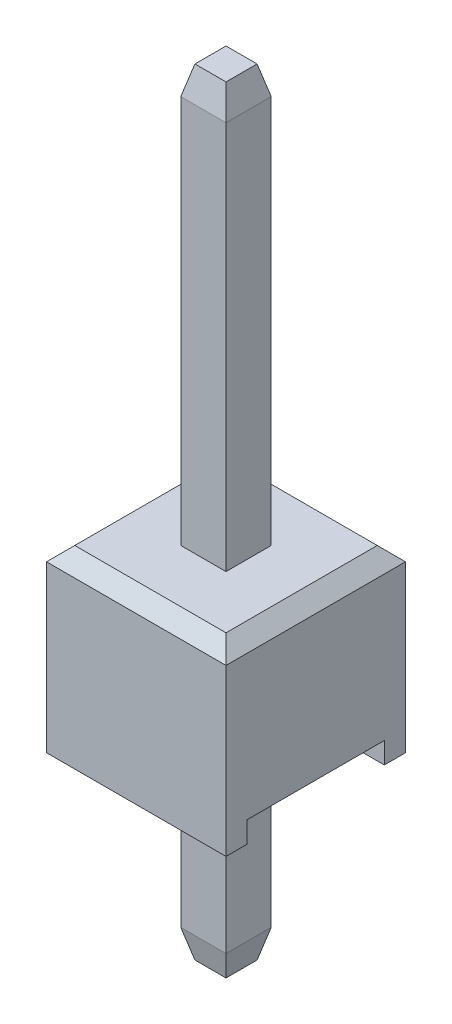
ISO-10303-21;
HEADER;
FILE_DESCRIPTION(('STEP AP214'),'2;1');
FILE_NAME('part.step','',(''),(''),'','','');
FILE_SCHEMA(('AUTOMOTIVE_DESIGN { 1 0 10303 214 1 1 1 1 }'));
ENDSEC;
DATA;
#1=APPLICATION_CONTEXT('core data for automotive mechanical design processes');
#2=APPLICATION_PROTOCOL_DEFINITION('international standard','automotive_design',2000,#1);
#3=PRODUCT_CONTEXT('',#1,'mechanical');
#4=PRODUCT('Part','Part','',(#3));
#5=PRODUCT_RELATED_PRODUCT_CATEGORY('part','',(#4));
#6=PRODUCT_DEFINITION_FORMATION('','',#4);
#7=PRODUCT_DEFINITION_CONTEXT('part definition',#1,'design');
#8=PRODUCT_DEFINITION('design','',#6,#7);
#9=PRODUCT_DEFINITION_SHAPE('','',#8);
#10=(LENGTH_UNIT() NAMED_UNIT(*) SI_UNIT(.MILLI.,.METRE.));
#11=(NAMED_UNIT(*) PLANE_ANGLE_UNIT() SI_UNIT($,.RADIAN.));
#12=(NAMED_UNIT(*) SI_UNIT($,.STERADIAN.) SOLID_ANGLE_UNIT());
#13=UNCERTAINTY_MEASURE_WITH_UNIT(LENGTH_MEASURE(1.E-05),#10,'distance_accuracy_value','');
#14=(GEOMETRIC_REPRESENTATION_CONTEXT(3) GLOBAL_UNCERTAINTY_ASSIGNED_CONTEXT((#13)) GLOBAL_UNIT_ASSIGNED_CONTEXT((#10,
#11,#12)) REPRESENTATION_CONTEXT('',''));
#15=CARTESIAN_POINT('',(0.,0.,0.));
#16=DIRECTION('',(0.,0.,1.));
#17=DIRECTION('',(1.,0.,0.));
#18=AXIS2_PLACEMENT_3D('',#15,#16,#17);
#19=CARTESIAN_POINT('',(-0.32,7.17000000000008,0.219999999999967));
#20=DIRECTION('',(0.,0.242535625036099,0.970142500145396));
#21=DIRECTION('',(0.,-0.970142500145396,0.242535625036099));
#22=AXIS2_PLACEMENT_3D('',#19,#20,#21);
#23=PLANE('',#22);
#24=DIRECTION('',(0.235702260395287,-0.942809041582121,0.235702260395516));
#25=VECTOR('',#24,1.);
#26=CARTESIAN_POINT('',(0.22,7.17000000000008,0.219999999999967));
#27=LINE('',#26,#25);
#28=CARTESIAN_POINT('',(0.220000000000001,7.17000000000008,0.219999999999967));
#29=VERTEX_POINT('',#28);
#30=CARTESIAN_POINT('',(0.319999999999976,6.76999999999998,0.319999999999999));
#31=VERTEX_POINT('',#30);
#32=EDGE_CURVE('E164',#29,#31,#27,.T.);
#33=ORIENTED_EDGE('',*,*,#32,.F.);
#34=DIRECTION('',(1.,0.,0.));
#35=VECTOR('',#34,1.);
#36=CARTESIAN_POINT('',(-0.32,7.17000000000008,0.219999999999967));
#37=LINE('',#36,#35);
#38=CARTESIAN_POINT('',(-0.22,7.17000000000008,0.219999999999967));
#39=VERTEX_POINT('',#38);
#40=EDGE_CURVE('E166',#29,#39,#37,.F.);
#41=ORIENTED_EDGE('',*,*,#40,.T.);
#42=DIRECTION('',(0.235702260395287,0.942809041582121,-0.235702260395516));
#43=VECTOR('',#42,1.);
#44=CARTESIAN_POINT('',(-0.319999999999903,6.76999999999998,0.320000000000048));
#45=LINE('',#44,#43);
#46=CARTESIAN_POINT('',(-0.319999999999988,6.76999999999998,0.319999999999999));
#47=VERTEX_POINT('',#46);
#48=EDGE_CURVE('E20',#47,#39,#45,.T.);
#49=ORIENTED_EDGE('',*,*,#48,.F.);
#50=DIRECTION('',(1.,0.,0.));
#51=VECTOR('',#50,1.);
#52=CARTESIAN_POINT('',(-0.32,6.77,0.320000000000048));
#53=LINE('',#52,#51);
#54=EDGE_CURVE('E189',#31,#47,#53,.F.);
#55=ORIENTED_EDGE('',*,*,#54,.F.);
#56=EDGE_LOOP('',(#33,#41,#49,#55));
#57=FACE_BOUND('',#56,.T.);
#58=ADVANCED_FACE('F17',(#57),#23,.T.);
#59=CARTESIAN_POINT('',(-0.32,-3.41000000000003,-0.320000000000001));
#60=DIRECTION('',(0.,0.242535625036099,0.970142500145396));
#61=DIRECTION('',(0.,-0.970142500145396,0.242535625036099));
#62=AXIS2_PLACEMENT_3D('',#59,#60,#61);
#63=PLANE('',#62);
#64=DIRECTION('',(-1.,0.,0.));
#65=VECTOR('',#64,1.);
#66=CARTESIAN_POINT('',(-0.32,-3.41000000000003,-0.320000000000001));
#67=LINE('',#66,#65);
#68=CARTESIAN_POINT('',(0.32,-3.41000000000003,-0.320000000000001));
#69=VERTEX_POINT('',#68);
#70=CARTESIAN_POINT('',(-0.32,-3.41000000000003,-0.320000000000001));
#71=VERTEX_POINT('',#70);
#72=EDGE_CURVE('E205',#69,#71,#67,.T.);
#73=ORIENTED_EDGE('',*,*,#72,.F.);
#74=DIRECTION('',(-0.235702260395287,-0.942809041582121,0.235702260395516));
#75=VECTOR('',#74,1.);
#76=CARTESIAN_POINT('',(0.32,-3.41000000000003,-0.320000000000001));
#77=LINE('',#76,#75);
#78=CARTESIAN_POINT('',(0.220000000000024,-3.81000000000005,-0.220000000000048));
#79=VERTEX_POINT('',#78);
#80=EDGE_CURVE('E201',#69,#79,#77,.T.);
#81=ORIENTED_EDGE('',*,*,#80,.T.);
#82=DIRECTION('',(1.,0.,0.));
#83=VECTOR('',#82,1.);
#84=CARTESIAN_POINT('',(-0.32,-3.81000000000003,-0.22));
#85=LINE('',#84,#83);
#86=CARTESIAN_POINT('',(-0.220000000000024,-3.81000000000004,-0.220000000000024));
#87=VERTEX_POINT('',#86);
#88=EDGE_CURVE('E193',#87,#79,#85,.T.);
#89=ORIENTED_EDGE('',*,*,#88,.F.);
#90=DIRECTION('',(-0.235702260395287,0.942809041582121,-0.235702260395516));
#91=VECTOR('',#90,1.);
#92=CARTESIAN_POINT('',(-0.220000000000097,-3.81000000000006,-0.22));
#93=LINE('',#92,#91);
#94=EDGE_CURVE('E199',#87,#71,#93,.T.);
#95=ORIENTED_EDGE('',*,*,#94,.T.);
#96=EDGE_LOOP('',(#73,#81,#89,#95));
#97=FACE_BOUND('',#96,.T.);
#98=ADVANCED_FACE('F688',(#97),#63,.F.);
#99=CARTESIAN_POINT('',(-0.22,7.17000000000016,-0.319999999999966));
#100=DIRECTION('',(-0.970142500145391,0.242535625036099,0.));
#101=DIRECTION('',(-0.242535625036098,-0.970142500145396,0.));
#102=AXIS2_PLACEMENT_3D('',#99,#100,#101);
#103=PLANE('',#102);
#104=DIRECTION('',(0.235702260395516,0.942809041582126,0.235702260395288));
#105=VECTOR('',#104,1.);
#106=CARTESIAN_POINT('',(-0.32,6.77000000000014,-0.319999999999904));
#107=LINE('',#106,#105);
#108=CARTESIAN_POINT('',(-0.319999999999951,6.77000000000015,-0.319999999999989));
#109=VERTEX_POINT('',#108);
#110=CARTESIAN_POINT('',(-0.22,7.17000000000008,-0.219999999999967));
#111=VERTEX_POINT('',#110);
#112=EDGE_CURVE('E219',#109,#111,#107,.T.);
#113=ORIENTED_EDGE('',*,*,#112,.F.);
#114=DIRECTION('',(0.,0.,1.00000000000001));
#115=VECTOR('',#114,1.);
#116=CARTESIAN_POINT('',(-0.32,6.77,0.320000000000048));
#117=LINE('',#116,#115);
#118=EDGE_CURVE('E178',#47,#109,#117,.F.);
#119=ORIENTED_EDGE('',*,*,#118,.F.);
#120=ORIENTED_EDGE('',*,*,#48,.T.);
#121=DIRECTION('',(0.,0.,-1.00000000000001));
#122=VECTOR('',#121,1.);
#123=CARTESIAN_POINT('',(-0.22,7.17000000000016,-0.319999999999966));
#124=LINE('',#123,#122);
#125=EDGE_CURVE('E172',#39,#111,#124,.T.);
#126=ORIENTED_EDGE('',*,*,#125,.T.);
#127=EDGE_LOOP('',(#113,#119,#120,#126));
#128=FACE_BOUND('',#127,.T.);
#129=ADVANCED_FACE('F175',(#128),#103,.T.);
#130=CARTESIAN_POINT('',(-0.32,7.17000000000016,-0.319999999999966));
#131=DIRECTION('',(0.,-1.00000000000001,0.));
#132=DIRECTION('',(0.,0.,-1.00000000000001));
#133=AXIS2_PLACEMENT_3D('',#130,#131,#132);
#134=PLANE('',#133);
#135=ORIENTED_EDGE('',*,*,#40,.F.);
#136=DIRECTION('',(0.,0.,1.00000000000001));
#137=VECTOR('',#136,1.);
#138=CARTESIAN_POINT('',(0.22,7.17000000000016,-0.319999999999966));
#139=LINE('',#138,#137);
#140=CARTESIAN_POINT('',(0.22,7.17000000000008,-0.219999999999967));
#141=VERTEX_POINT('',#140);
#142=EDGE_CURVE('E185',#141,#29,#139,.T.);
#143=ORIENTED_EDGE('',*,*,#142,.F.);
#144=DIRECTION('',(1.,0.,0.));
#145=VECTOR('',#144,1.);
#146=CARTESIAN_POINT('',(-0.32,7.17000000000008,-0.219999999999967));
#147=LINE('',#146,#145);
#148=EDGE_CURVE('E182',#111,#141,#147,.T.);
#149=ORIENTED_EDGE('',*,*,#148,.F.);
#150=ORIENTED_EDGE('',*,*,#125,.F.);
#151=EDGE_LOOP('',(#135,#143,#149,#150));
#152=FACE_BOUND('',#151,.T.);
#153=ADVANCED_FACE('F180',(#152),#134,.F.);
#154=CARTESIAN_POINT('',(0.22,7.17000000000016,-0.319999999999966));
#155=DIRECTION('',(0.970142500145391,0.242535625036099,0.));
#156=DIRECTION('',(-0.242535625036098,0.970142500145396,0.));
#157=AXIS2_PLACEMENT_3D('',#154,#155,#156);
#158=PLANE('',#157);
#159=DIRECTION('',(0.235702260395516,-0.942809041582126,-0.235702260395288));
#160=VECTOR('',#159,1.);
#161=CARTESIAN_POINT('',(0.220000000000001,7.17000000000008,-0.219999999999967));
#162=LINE('',#161,#160);
#163=CARTESIAN_POINT('',(0.319999999999951,6.77000000000015,-0.319999999999977));
#164=VERTEX_POINT('',#163);
#165=EDGE_CURVE('E216',#141,#164,#162,.T.);
#166=ORIENTED_EDGE('',*,*,#165,.F.);
#167=ORIENTED_EDGE('',*,*,#142,.T.);
#168=ORIENTED_EDGE('',*,*,#32,.T.);
#169=DIRECTION('',(0.,0.,-1.00000000000001));
#170=VECTOR('',#169,1.);
#171=CARTESIAN_POINT('',(0.32,6.77,0.320000000000048));
#172=LINE('',#171,#170);
#173=EDGE_CURVE('E222',#164,#31,#172,.F.);
#174=ORIENTED_EDGE('',*,*,#173,.F.);
#175=EDGE_LOOP('',(#166,#167,#168,#174));
#176=FACE_BOUND('',#175,.T.);
#177=ADVANCED_FACE('F664',(#176),#158,.T.);
#178=CARTESIAN_POINT('',(-0.32,-3.81000000000002,0.320000000000023));
#179=DIRECTION('',(0.,0.,1.00000000000001));
#180=DIRECTION('',(1.,0.,0.));
#181=AXIS2_PLACEMENT_3D('',#178,#179,#180);
#182=PLANE('',#181);
#183=DIRECTION('',(0.,1.00000000000001,0.));
#184=VECTOR('',#183,1.);
#185=CARTESIAN_POINT('',(-0.32,-3.81000000000002,0.320000000000023));
#186=LINE('',#185,#184);
#187=CARTESIAN_POINT('',(-0.32,1.27,0.320000000000023));
#188=VERTEX_POINT('',#187);
#189=EDGE_CURVE('E210',#188,#47,#186,.T.);
#190=ORIENTED_EDGE('',*,*,#189,.F.);
#191=DIRECTION('',(1.,0.,0.));
#192=VECTOR('',#191,1.);
#193=CARTESIAN_POINT('',(-0.32,1.27,0.320000000000023));
#194=LINE('',#193,#192);
#195=CARTESIAN_POINT('',(0.32,1.27,0.320000000000023));
#196=VERTEX_POINT('',#195);
#197=EDGE_CURVE('E191',#188,#196,#194,.T.);
#198=ORIENTED_EDGE('',*,*,#197,.T.);
#199=DIRECTION('',(0.,1.00000000000001,0.));
#200=VECTOR('',#199,1.);
#201=CARTESIAN_POINT('',(0.32,-3.81000000000002,0.320000000000023));
#202=LINE('',#201,#200);
#203=EDGE_CURVE('E225',#31,#196,#202,.F.);
#204=ORIENTED_EDGE('',*,*,#203,.F.);
#205=ORIENTED_EDGE('',*,*,#54,.T.);
#206=EDGE_LOOP('',(#190,#198,#204,#205));
#207=FACE_BOUND('',#206,.T.);
#208=ADVANCED_FACE('F655',(#207),#182,.T.);
#209=CARTESIAN_POINT('',(-0.32,-3.81000000000003,-0.319999999999999));
#210=DIRECTION('',(0.,-1.00000000000001,0.));
#211=DIRECTION('',(0.,0.,-1.00000000000001));
#212=AXIS2_PLACEMENT_3D('',#209,#210,#211);
#213=PLANE('',#212);
#214=DIRECTION('',(0.,0.,1.00000000000001));
#215=VECTOR('',#214,1.);
#216=CARTESIAN_POINT('',(-0.220000000000097,-3.81000000000004,0.320000000000023));
#217=LINE('',#216,#215);
#218=CARTESIAN_POINT('',(-0.220000000000024,-3.81000000000003,0.220000000000024));
#219=VERTEX_POINT('',#218);
#220=EDGE_CURVE('E196',#219,#87,#217,.F.);
#221=ORIENTED_EDGE('',*,*,#220,.T.);
#222=ORIENTED_EDGE('',*,*,#88,.T.);
#223=DIRECTION('',(0.,0.,1.00000000000001));
#224=VECTOR('',#223,1.);
#225=CARTESIAN_POINT('',(0.220000000000097,-3.81000000000004,0.320000000000023));
#226=LINE('',#225,#224);
#227=CARTESIAN_POINT('',(0.220000000000024,-3.81000000000003,0.220000000000024));
#228=VERTEX_POINT('',#227);
#229=EDGE_CURVE('E203',#79,#228,#226,.T.);
#230=ORIENTED_EDGE('',*,*,#229,.T.);
#231=DIRECTION('',(1.,0.,0.));
#232=VECTOR('',#231,1.);
#233=CARTESIAN_POINT('',(-0.32,-3.81000000000004,0.220000000000097));
#234=LINE('',#233,#232);
#235=EDGE_CURVE('E239',#228,#219,#234,.F.);
#236=ORIENTED_EDGE('',*,*,#235,.T.);
#237=EDGE_LOOP('',(#221,#222,#230,#236));
#238=FACE_BOUND('',#237,.T.);
#239=ADVANCED_FACE('F646',(#238),#213,.T.);
#240=CARTESIAN_POINT('',(-0.32,-3.41000000000003,0.320000000000048));
#241=DIRECTION('',(0.970142500145391,0.242535625036099,0.));
#242=DIRECTION('',(-0.242535625036098,0.970142500145396,0.));
#243=AXIS2_PLACEMENT_3D('',#240,#241,#242);
#244=PLANE('',#243);
#245=DIRECTION('',(0.,0.,1.00000000000001));
#246=VECTOR('',#245,1.);
#247=CARTESIAN_POINT('',(-0.32,-3.41000000000003,0.320000000000048));
#248=LINE('',#247,#246);
#249=CARTESIAN_POINT('',(-0.32,-3.41000000000003,0.320000000000048));
#250=VERTEX_POINT('',#249);
#251=EDGE_CURVE('E233',#71,#250,#248,.T.);
#252=ORIENTED_EDGE('',*,*,#251,.F.);
#253=ORIENTED_EDGE('',*,*,#94,.F.);
#254=ORIENTED_EDGE('',*,*,#220,.F.);
#255=DIRECTION('',(-0.235702260395516,0.942809041582126,0.235702260395289));
#256=VECTOR('',#255,1.);
#257=CARTESIAN_POINT('',(-0.22,-3.81000000000004,0.220000000000097));
#258=LINE('',#257,#256);
#259=EDGE_CURVE('E241',#219,#250,#258,.T.);
#260=ORIENTED_EDGE('',*,*,#259,.T.);
#261=EDGE_LOOP('',(#252,#253,#254,#260));
#262=FACE_BOUND('',#261,.T.);
#263=ADVANCED_FACE('F637',(#262),#244,.F.);
#264=CARTESIAN_POINT('',(0.32,-3.41000000000003,0.320000000000048));
#265=DIRECTION('',(-0.970142500145391,0.242535625036099,0.));
#266=DIRECTION('',(-0.242535625036098,-0.970142500145396,0.));
#267=AXIS2_PLACEMENT_3D('',#264,#265,#266);
#268=PLANE('',#267);
#269=ORIENTED_EDGE('',*,*,#229,.F.);
#270=ORIENTED_EDGE('',*,*,#80,.F.);
#271=DIRECTION('',(0.,0.,-1.00000000000001));
#272=VECTOR('',#271,1.);
#273=CARTESIAN_POINT('',(0.32,-3.41000000000003,0.320000000000048));
#274=LINE('',#273,#272);
#275=CARTESIAN_POINT('',(0.32,-3.41000000000003,0.320000000000048));
#276=VERTEX_POINT('',#275);
#277=EDGE_CURVE('E246',#276,#69,#274,.T.);
#278=ORIENTED_EDGE('',*,*,#277,.F.);
#279=DIRECTION('',(-0.235702260395516,-0.942809041582126,-0.235702260395289));
#280=VECTOR('',#279,1.);
#281=CARTESIAN_POINT('',(0.32,-3.41000000000003,0.320000000000048));
#282=LINE('',#281,#280);
#283=EDGE_CURVE('E243',#276,#228,#282,.T.);
#284=ORIENTED_EDGE('',*,*,#283,.T.);
#285=EDGE_LOOP('',(#269,#270,#278,#284));
#286=FACE_BOUND('',#285,.T.);
#287=ADVANCED_FACE('F628',(#286),#268,.F.);
#288=CARTESIAN_POINT('',(-0.32,-3.81000000000003,-0.319999999999999));
#289=DIRECTION('',(0.,0.,-1.00000000000001));
#290=DIRECTION('',(-1.,0.,0.));
#291=AXIS2_PLACEMENT_3D('',#288,#289,#290);
#292=PLANE('',#291);
#293=DIRECTION('',(0.,1.00000000000001,0.));
#294=VECTOR('',#293,1.);
#295=CARTESIAN_POINT('',(-0.32,-3.81000000000003,-0.319999999999999));
#296=LINE('',#295,#294);
#297=CARTESIAN_POINT('',(-0.32,-0.970000000000011,-0.319999999999966));
#298=VERTEX_POINT('',#297);
#299=EDGE_CURVE('E230',#298,#71,#296,.F.);
#300=ORIENTED_EDGE('',*,*,#299,.F.);
#301=DIRECTION('',(-1.,0.,0.));
#302=VECTOR('',#301,1.);
#303=CARTESIAN_POINT('',(-0.32,-0.970000000000012,-0.319999999999966));
#304=LINE('',#303,#302);
#305=CARTESIAN_POINT('',(0.32,-0.970000000000011,-0.319999999999966));
#306=VERTEX_POINT('',#305);
#307=EDGE_CURVE('E208',#298,#306,#304,.F.);
#308=ORIENTED_EDGE('',*,*,#307,.T.);
#309=DIRECTION('',(0.,1.00000000000001,0.));
#310=VECTOR('',#309,1.);
#311=CARTESIAN_POINT('',(0.32,-3.81000000000003,-0.319999999999999));
#312=LINE('',#311,#310);
#313=EDGE_CURVE('E249',#69,#306,#312,.T.);
#314=ORIENTED_EDGE('',*,*,#313,.F.);
#315=ORIENTED_EDGE('',*,*,#72,.T.);
#316=EDGE_LOOP('',(#300,#308,#314,#315));
#317=FACE_BOUND('',#316,.T.);
#318=ADVANCED_FACE('F619',(#317),#292,.T.);
#319=CARTESIAN_POINT('',(-0.32,-3.81000000000002,0.320000000000023));
#320=DIRECTION('',(-1.,0.,0.));
#321=DIRECTION('',(0.,0.,1.00000000000001));
#322=AXIS2_PLACEMENT_3D('',#319,#320,#321);
#323=PLANE('',#322);
#324=DIRECTION('',(0.,1.00000000000001,0.));
#325=VECTOR('',#324,1.);
#326=CARTESIAN_POINT('',(-0.32,-3.81000000000003,-0.319999999999999));
#327=LINE('',#326,#325);
#328=CARTESIAN_POINT('',(-0.32,1.27,-0.319999999999999));
#329=VERTEX_POINT('',#328);
#330=EDGE_CURVE('E254',#329,#109,#327,.T.);
#331=ORIENTED_EDGE('',*,*,#330,.F.);
#332=DIRECTION('',(0.,0.,1.00000000000001));
#333=VECTOR('',#332,1.);
#334=CARTESIAN_POINT('',(-0.32,1.27,0.320000000000023));
#335=LINE('',#334,#333);
#336=EDGE_CURVE('E213',#329,#188,#335,.T.);
#337=ORIENTED_EDGE('',*,*,#336,.T.);
#338=ORIENTED_EDGE('',*,*,#189,.T.);
#339=ORIENTED_EDGE('',*,*,#118,.T.);
#340=EDGE_LOOP('',(#331,#337,#338,#339));
#341=FACE_BOUND('',#340,.T.);
#342=ADVANCED_FACE('F610',(#341),#323,.T.);
#343=CARTESIAN_POINT('',(-0.32,7.17000000000008,-0.219999999999967));
#344=DIRECTION('',(0.,0.242535625036098,-0.970142500145396));
#345=DIRECTION('',(0.,0.970142500145396,0.242535625036098));
#346=AXIS2_PLACEMENT_3D('',#343,#344,#345);
#347=PLANE('',#346);
#348=ORIENTED_EDGE('',*,*,#112,.T.);
#349=ORIENTED_EDGE('',*,*,#148,.T.);
#350=ORIENTED_EDGE('',*,*,#165,.T.);
#351=DIRECTION('',(-1.,0.,0.));
#352=VECTOR('',#351,1.);
#353=CARTESIAN_POINT('',(-0.32,6.77000000000016,-0.320000000000001));
#354=LINE('',#353,#352);
#355=EDGE_CURVE('E257',#109,#164,#354,.F.);
#356=ORIENTED_EDGE('',*,*,#355,.F.);
#357=EDGE_LOOP('',(#348,#349,#350,#356));
#358=FACE_BOUND('',#357,.T.);
#359=ADVANCED_FACE('F601',(#358),#347,.T.);
#360=CARTESIAN_POINT('',(0.32,-3.81000000000002,0.320000000000023));
#361=DIRECTION('',(1.,0.,0.));
#362=DIRECTION('',(0.,0.,-1.00000000000001));
#363=AXIS2_PLACEMENT_3D('',#360,#361,#362);
#364=PLANE('',#363);
#365=ORIENTED_EDGE('',*,*,#203,.T.);
#366=DIRECTION('',(0.,0.,-1.00000000000001));
#367=VECTOR('',#366,1.);
#368=CARTESIAN_POINT('',(0.32,1.27,0.320000000000023));
#369=LINE('',#368,#367);
#370=CARTESIAN_POINT('',(0.32,1.27,-0.319999999999999));
#371=VERTEX_POINT('',#370);
#372=EDGE_CURVE('E228',#196,#371,#369,.T.);
#373=ORIENTED_EDGE('',*,*,#372,.T.);
#374=DIRECTION('',(0.,1.00000000000001,0.));
#375=VECTOR('',#374,1.);
#376=CARTESIAN_POINT('',(0.32,-3.81000000000003,-0.319999999999999));
#377=LINE('',#376,#375);
#378=EDGE_CURVE('E260',#164,#371,#377,.F.);
#379=ORIENTED_EDGE('',*,*,#378,.F.);
#380=ORIENTED_EDGE('',*,*,#173,.T.);
#381=EDGE_LOOP('',(#365,#373,#379,#380));
#382=FACE_BOUND('',#381,.T.);
#383=ADVANCED_FACE('F592',(#382),#364,.T.);
#384=CARTESIAN_POINT('',(-0.32,-3.81000000000002,0.320000000000023));
#385=DIRECTION('',(-1.,0.,0.));
#386=DIRECTION('',(0.,0.,1.00000000000001));
#387=AXIS2_PLACEMENT_3D('',#384,#385,#386);
#388=PLANE('',#387);
#389=DIRECTION('',(0.,1.00000000000001,0.));
#390=VECTOR('',#389,1.);
#391=CARTESIAN_POINT('',(-0.32,-3.81000000000002,0.320000000000023));
#392=LINE('',#391,#390);
#393=CARTESIAN_POINT('',(-0.32,-0.970000000000006,0.319999999999966));
#394=VERTEX_POINT('',#393);
#395=EDGE_CURVE('E263',#394,#250,#392,.F.);
#396=ORIENTED_EDGE('',*,*,#395,.F.);
#397=DIRECTION('',(0.,0.,1.00000000000001));
#398=VECTOR('',#397,1.);
#399=CARTESIAN_POINT('',(-0.32,-0.970000000000006,0.319999999999966));
#400=LINE('',#399,#398);
#401=EDGE_CURVE('E236',#394,#298,#400,.F.);
#402=ORIENTED_EDGE('',*,*,#401,.T.);
#403=ORIENTED_EDGE('',*,*,#299,.T.);
#404=ORIENTED_EDGE('',*,*,#251,.T.);
#405=EDGE_LOOP('',(#396,#402,#403,#404));
#406=FACE_BOUND('',#405,.T.);
#407=ADVANCED_FACE('F583',(#406),#388,.T.);
#408=CARTESIAN_POINT('',(-0.32,-3.41000000000003,0.320000000000048));
#409=DIRECTION('',(0.,0.242535625036098,-0.970142500145396));
#410=DIRECTION('',(0.,0.970142500145396,0.242535625036098));
#411=AXIS2_PLACEMENT_3D('',#408,#409,#410);
#412=PLANE('',#411);
#413=DIRECTION('',(1.,0.,0.));
#414=VECTOR('',#413,1.);
#415=CARTESIAN_POINT('',(-0.32,-3.41000000000003,0.320000000000048));
#416=LINE('',#415,#414);
#417=EDGE_CURVE('E266',#250,#276,#416,.T.);
#418=ORIENTED_EDGE('',*,*,#417,.F.);
#419=ORIENTED_EDGE('',*,*,#259,.F.);
#420=ORIENTED_EDGE('',*,*,#235,.F.);
#421=ORIENTED_EDGE('',*,*,#283,.F.);
#422=EDGE_LOOP('',(#418,#419,#420,#421));
#423=FACE_BOUND('',#422,.T.);
#424=ADVANCED_FACE('F574',(#423),#412,.F.);
#425=CARTESIAN_POINT('',(0.32,-3.81000000000002,0.320000000000023));
#426=DIRECTION('',(1.,0.,0.));
#427=DIRECTION('',(0.,0.,-1.00000000000001));
#428=AXIS2_PLACEMENT_3D('',#425,#426,#427);
#429=PLANE('',#428);
#430=ORIENTED_EDGE('',*,*,#313,.T.);
#431=DIRECTION('',(0.,0.,-1.00000000000001));
#432=VECTOR('',#431,1.);
#433=CARTESIAN_POINT('',(0.32,-0.970000000000006,0.319999999999966));
#434=LINE('',#433,#432);
#435=CARTESIAN_POINT('',(0.32,-0.970000000000006,0.319999999999966));
#436=VERTEX_POINT('',#435);
#437=EDGE_CURVE('E252',#306,#436,#434,.F.);
#438=ORIENTED_EDGE('',*,*,#437,.T.);
#439=DIRECTION('',(0.,1.00000000000001,0.));
#440=VECTOR('',#439,1.);
#441=CARTESIAN_POINT('',(0.32,-3.81000000000002,0.320000000000023));
#442=LINE('',#441,#440);
#443=EDGE_CURVE('E269',#276,#436,#442,.T.);
#444=ORIENTED_EDGE('',*,*,#443,.F.);
#445=ORIENTED_EDGE('',*,*,#277,.T.);
#446=EDGE_LOOP('',(#430,#438,#444,#445));
#447=FACE_BOUND('',#446,.T.);
#448=ADVANCED_FACE('F565',(#447),#429,.T.);
#449=CARTESIAN_POINT('',(-0.32,-3.81000000000003,-0.319999999999999));
#450=DIRECTION('',(0.,0.,-1.00000000000001));
#451=DIRECTION('',(-1.,0.,0.));
#452=AXIS2_PLACEMENT_3D('',#449,#450,#451);
#453=PLANE('',#452);
#454=ORIENTED_EDGE('',*,*,#378,.T.);
#455=DIRECTION('',(1.,0.,0.));
#456=VECTOR('',#455,1.);
#457=CARTESIAN_POINT('',(-1.27,1.27,-0.319999999999999));
#458=LINE('',#457,#456);
#459=EDGE_CURVE('E290',#371,#329,#458,.F.);
#460=ORIENTED_EDGE('',*,*,#459,.T.);
#461=ORIENTED_EDGE('',*,*,#330,.T.);
#462=ORIENTED_EDGE('',*,*,#355,.T.);
#463=EDGE_LOOP('',(#454,#460,#461,#462));
#464=FACE_BOUND('',#463,.T.);
#465=ADVANCED_FACE('F556',(#464),#453,.T.);
#466=CARTESIAN_POINT('',(-0.32,-3.81000000000002,0.320000000000023));
#467=DIRECTION('',(0.,0.,1.00000000000001));
#468=DIRECTION('',(1.,0.,0.));
#469=AXIS2_PLACEMENT_3D('',#466,#467,#468);
#470=PLANE('',#469);
#471=ORIENTED_EDGE('',*,*,#443,.T.);
#472=DIRECTION('',(-1.,0.,0.));
#473=VECTOR('',#472,1.);
#474=CARTESIAN_POINT('',(-1.27,-0.970000000000006,0.319999999999966));
#475=LINE('',#474,#473);
#476=EDGE_CURVE('E299',#436,#394,#475,.T.);
#477=ORIENTED_EDGE('',*,*,#476,.T.);
#478=ORIENTED_EDGE('',*,*,#395,.T.);
#479=ORIENTED_EDGE('',*,*,#417,.T.);
#480=EDGE_LOOP('',(#471,#477,#478,#479));
#481=FACE_BOUND('',#480,.T.);
#482=ADVANCED_FACE('F546',(#481),#470,.T.);
#483=CARTESIAN_POINT('',(-1.27,-1.27000000000001,-0.970000000000026));
#484=DIRECTION('',(0.,0.,-1.00000000000001));
#485=DIRECTION('',(-1.,0.,0.));
#486=AXIS2_PLACEMENT_3D('',#483,#484,#485);
#487=PLANE('',#486);
#488=DIRECTION('',(1.,0.,0.));
#489=VECTOR('',#488,1.);
#490=CARTESIAN_POINT('',(-1.27,-1.27000000000001,-0.970000000000026));
#491=LINE('',#490,#489);
#492=CARTESIAN_POINT('',(-1.27,-1.27000000000001,-0.970000000000026));
#493=VERTEX_POINT('',#492);
#494=CARTESIAN_POINT('',(1.27,-1.27000000000001,-0.970000000000026));
#495=VERTEX_POINT('',#494);
#496=EDGE_CURVE('E278',#493,#495,#491,.T.);
#497=ORIENTED_EDGE('',*,*,#496,.T.);
#498=DIRECTION('',(0.,1.00000000000001,0.));
#499=VECTOR('',#498,1.);
#500=CARTESIAN_POINT('',(1.27,-1.27000000000001,-0.970000000000026));
#501=LINE('',#500,#499);
#502=CARTESIAN_POINT('',(1.27,-0.970000000000008,-0.97));
#503=VERTEX_POINT('',#502);
#504=EDGE_CURVE('E272',#503,#495,#501,.F.);
#505=ORIENTED_EDGE('',*,*,#504,.F.);
#506=DIRECTION('',(-1.,0.,0.));
#507=VECTOR('',#506,1.);
#508=CARTESIAN_POINT('',(-1.27,-0.970000000000008,-0.97));
#509=LINE('',#508,#507);
#510=CARTESIAN_POINT('',(-1.27,-0.970000000000008,-0.97));
#511=VERTEX_POINT('',#510);
#512=EDGE_CURVE('E302',#503,#511,#509,.T.);
#513=ORIENTED_EDGE('',*,*,#512,.T.);
#514=DIRECTION('',(0.,1.00000000000001,0.));
#515=VECTOR('',#514,1.);
#516=CARTESIAN_POINT('',(-1.27,-1.27000000000001,-0.970000000000026));
#517=LINE('',#516,#515);
#518=EDGE_CURVE('E274',#493,#511,#517,.T.);
#519=ORIENTED_EDGE('',*,*,#518,.F.);
#520=EDGE_LOOP('',(#497,#505,#513,#519));
#521=FACE_BOUND('',#520,.T.);
#522=ADVANCED_FACE('F388',(#521),#487,.F.);
#523=CARTESIAN_POINT('',(-1.27,1.27000000000002,-1.07000000000003));
#524=DIRECTION('',(0.,-0.707106781186548,0.707106781186553));
#525=DIRECTION('',(0.,-0.707106781186553,-0.707106781186548));
#526=AXIS2_PLACEMENT_3D('',#523,#524,#525);
#527=PLANE('',#526);
#528=DIRECTION('',(1.,0.,0.));
#529=VECTOR('',#528,1.);
#530=CARTESIAN_POINT('',(-1.27,1.07,-1.27));
#531=LINE('',#530,#529);
#532=CARTESIAN_POINT('',(1.27,1.07,-1.27));
#533=VERTEX_POINT('',#532);
#534=CARTESIAN_POINT('',(-1.27,1.07,-1.27));
#535=VERTEX_POINT('',#534);
#536=EDGE_CURVE('E305',#533,#535,#531,.F.);
#537=ORIENTED_EDGE('',*,*,#536,.T.);
#538=DIRECTION('',(-0.577350269189626,-0.57735026918962,-0.577350269189626));
#539=VECTOR('',#538,1.);
#540=CARTESIAN_POINT('',(-1.07,1.27000000000002,-1.07000000000003));
#541=LINE('',#540,#539);
#542=CARTESIAN_POINT('',(-1.07,1.27000000000001,-1.07000000000003));
#543=VERTEX_POINT('',#542);
#544=EDGE_CURVE('E276',#543,#535,#541,.T.);
#545=ORIENTED_EDGE('',*,*,#544,.F.);
#546=DIRECTION('',(1.,0.,0.));
#547=VECTOR('',#546,1.);
#548=CARTESIAN_POINT('',(-1.27,1.27000000000002,-1.07000000000003));
#549=LINE('',#548,#547);
#550=CARTESIAN_POINT('',(1.07,1.27000000000001,-1.07000000000003));
#551=VERTEX_POINT('',#550);
#552=EDGE_CURVE('E296',#543,#551,#549,.T.);
#553=ORIENTED_EDGE('',*,*,#552,.T.);
#554=DIRECTION('',(0.577350269189626,-0.57735026918962,-0.577350269189626));
#555=VECTOR('',#554,1.);
#556=CARTESIAN_POINT('',(1.07,1.27000000000002,-1.07000000000003));
#557=LINE('',#556,#555);
#558=EDGE_CURVE('E288',#551,#533,#557,.T.);
#559=ORIENTED_EDGE('',*,*,#558,.T.);
#560=EDGE_LOOP('',(#537,#545,#553,#559));
#561=FACE_BOUND('',#560,.T.);
#562=ADVANCED_FACE('F375',(#561),#527,.F.);
#563=CARTESIAN_POINT('',(-1.27,-1.27000000000001,1.27));
#564=DIRECTION('',(0.,1.00000000000001,0.));
#565=DIRECTION('',(0.,0.,1.00000000000001));
#566=AXIS2_PLACEMENT_3D('',#563,#564,#565);
#567=PLANE('',#566);
#568=DIRECTION('',(1.,0.,0.));
#569=VECTOR('',#568,1.);
#570=CARTESIAN_POINT('',(-1.27,-1.27000000000001,-1.26999999999995));
#571=LINE('',#570,#569);
#572=CARTESIAN_POINT('',(-1.27,-1.27000000000001,-1.26999999999995));
#573=VERTEX_POINT('',#572);
#574=CARTESIAN_POINT('',(1.27,-1.27000000000001,-1.26999999999995));
#575=VERTEX_POINT('',#574);
#576=EDGE_CURVE('E308',#573,#575,#571,.T.);
#577=ORIENTED_EDGE('',*,*,#576,.T.);
#578=DIRECTION('',(0.,0.,1.00000000000001));
#579=VECTOR('',#578,1.);
#580=CARTESIAN_POINT('',(1.27,-1.27000000000001,1.27));
#581=LINE('',#580,#579);
#582=EDGE_CURVE('E281',#495,#575,#581,.F.);
#583=ORIENTED_EDGE('',*,*,#582,.F.);
#584=ORIENTED_EDGE('',*,*,#496,.F.);
#585=DIRECTION('',(0.,0.,1.00000000000001));
#586=VECTOR('',#585,1.);
#587=CARTESIAN_POINT('',(-1.27,-1.27000000000001,1.27));
#588=LINE('',#587,#586);
#589=EDGE_CURVE('E283',#573,#493,#588,.T.);
#590=ORIENTED_EDGE('',*,*,#589,.F.);
#591=EDGE_LOOP('',(#577,#583,#584,#590));
#592=FACE_BOUND('',#591,.T.);
#593=ADVANCED_FACE('F383',(#592),#567,.F.);
#594=CARTESIAN_POINT('',(1.07,1.27,1.27));
#595=DIRECTION('',(-0.707106781186548,-0.707106781186548,0.));
#596=DIRECTION('',(0.707106781186548,-0.707106781186548,0.));
#597=AXIS2_PLACEMENT_3D('',#594,#595,#596);
#598=PLANE('',#597);
#599=DIRECTION('',(0.,0.,-1.00000000000001));
#600=VECTOR('',#599,1.);
#601=CARTESIAN_POINT('',(1.07,1.27,1.27));
#602=LINE('',#601,#600);
#603=CARTESIAN_POINT('',(1.07,1.27000000000001,1.07));
#604=VERTEX_POINT('',#603);
#605=EDGE_CURVE('E293',#551,#604,#602,.F.);
#606=ORIENTED_EDGE('',*,*,#605,.T.);
#607=DIRECTION('',(-0.577350269189626,0.577350269189626,-0.577350269189621));
#608=VECTOR('',#607,1.);
#609=CARTESIAN_POINT('',(1.27,1.07,1.27000000000002));
#610=LINE('',#609,#608);
#611=CARTESIAN_POINT('',(1.27,1.07,1.27000000000002));
#612=VERTEX_POINT('',#611);
#613=EDGE_CURVE('E286',#612,#604,#610,.T.);
#614=ORIENTED_EDGE('',*,*,#613,.F.);
#615=DIRECTION('',(0.,0.,1.00000000000001));
#616=VECTOR('',#615,1.);
#617=CARTESIAN_POINT('',(1.27,1.07,1.27000000000002));
#618=LINE('',#617,#616);
#619=EDGE_CURVE('E317',#612,#533,#618,.F.);
#620=ORIENTED_EDGE('',*,*,#619,.T.);
#621=ORIENTED_EDGE('',*,*,#558,.F.);
#622=EDGE_LOOP('',(#606,#614,#620,#621));
#623=FACE_BOUND('',#622,.T.);
#624=ADVANCED_FACE('F404',(#623),#598,.F.);
#625=CARTESIAN_POINT('',(-1.27,1.27,1.27));
#626=DIRECTION('',(0.,-1.00000000000001,0.));
#627=DIRECTION('',(0.,0.,-1.00000000000001));
#628=AXIS2_PLACEMENT_3D('',#625,#626,#627);
#629=PLANE('',#628);
#630=DIRECTION('',(0.,0.,1.00000000000001));
#631=VECTOR('',#630,1.);
#632=CARTESIAN_POINT('',(-1.07,1.27,1.27));
#633=LINE('',#632,#631);
#634=CARTESIAN_POINT('',(-1.07,1.27000000000001,1.07));
#635=VERTEX_POINT('',#634);
#636=EDGE_CURVE('E311',#543,#635,#633,.T.);
#637=ORIENTED_EDGE('',*,*,#636,.T.);
#638=DIRECTION('',(1.,0.,0.));
#639=VECTOR('',#638,1.);
#640=CARTESIAN_POINT('',(-1.27,1.27000000000001,1.07));
#641=LINE('',#640,#639);
#642=EDGE_CURVE('E329',#604,#635,#641,.F.);
#643=ORIENTED_EDGE('',*,*,#642,.F.);
#644=ORIENTED_EDGE('',*,*,#605,.F.);
#645=ORIENTED_EDGE('',*,*,#552,.F.);
#646=EDGE_LOOP('',(#637,#643,#644,#645));
#647=FACE_BOUND('',#646,.T.);
#648=ORIENTED_EDGE('',*,*,#372,.F.);
#649=ORIENTED_EDGE('',*,*,#197,.F.);
#650=ORIENTED_EDGE('',*,*,#336,.F.);
#651=ORIENTED_EDGE('',*,*,#459,.F.);
#652=EDGE_LOOP('',(#648,#649,#650,#651));
#653=FACE_BOUND('',#652,.T.);
#654=ADVANCED_FACE('F371',(#647,#653),#629,.F.);
#655=CARTESIAN_POINT('',(-1.27,-0.970000000000008,0.970000000000025));
#656=DIRECTION('',(0.,1.00000000000001,0.));
#657=DIRECTION('',(-1.,0.,0.));
#658=AXIS2_PLACEMENT_3D('',#655,#656,#657);
#659=PLANE('',#658);
#660=ORIENTED_EDGE('',*,*,#512,.F.);
#661=DIRECTION('',(0.,0.,1.00000000000001));
#662=VECTOR('',#661,1.);
#663=CARTESIAN_POINT('',(1.27,-0.970000000000011,1.27000000000002));
#664=LINE('',#663,#662);
#665=CARTESIAN_POINT('',(1.27,-0.970000000000008,0.970000000000025));
#666=VERTEX_POINT('',#665);
#667=EDGE_CURVE('E323',#503,#666,#664,.T.);
#668=ORIENTED_EDGE('',*,*,#667,.T.);
#669=DIRECTION('',(1.,0.,0.));
#670=VECTOR('',#669,1.);
#671=CARTESIAN_POINT('',(-1.27,-0.970000000000008,0.970000000000025));
#672=LINE('',#671,#670);
#673=CARTESIAN_POINT('',(-1.27,-0.970000000000008,0.970000000000025));
#674=VERTEX_POINT('',#673);
#675=EDGE_CURVE('E313',#666,#674,#672,.F.);
#676=ORIENTED_EDGE('',*,*,#675,.T.);
#677=DIRECTION('',(0.,0.,1.00000000000001));
#678=VECTOR('',#677,1.);
#679=CARTESIAN_POINT('',(-1.27,-0.970000000000011,1.27000000000002));
#680=LINE('',#679,#678);
#681=EDGE_CURVE('E335',#674,#511,#680,.F.);
#682=ORIENTED_EDGE('',*,*,#681,.T.);
#683=EDGE_LOOP('',(#660,#668,#676,#682));
#684=FACE_BOUND('',#683,.T.);
#685=ORIENTED_EDGE('',*,*,#437,.F.);
#686=ORIENTED_EDGE('',*,*,#307,.F.);
#687=ORIENTED_EDGE('',*,*,#401,.F.);
#688=ORIENTED_EDGE('',*,*,#476,.F.);
#689=EDGE_LOOP('',(#685,#686,#687,#688));
#690=FACE_BOUND('',#689,.T.);
#691=ADVANCED_FACE('F391',(#684,#690),#659,.F.);
#692=CARTESIAN_POINT('',(-1.27,-1.27000000000001,-1.26999999999995));
#693=DIRECTION('',(0.,0.,1.00000000000001));
#694=DIRECTION('',(1.,0.,0.));
#695=AXIS2_PLACEMENT_3D('',#692,#693,#694);
#696=PLANE('',#695);
#697=ORIENTED_EDGE('',*,*,#576,.F.);
#698=DIRECTION('',(0.,1.00000000000001,0.));
#699=VECTOR('',#698,1.);
#700=CARTESIAN_POINT('',(-1.27,1.27,-1.26999999999995));
#701=LINE('',#700,#699);
#702=EDGE_CURVE('E338',#573,#535,#701,.T.);
#703=ORIENTED_EDGE('',*,*,#702,.T.);
#704=ORIENTED_EDGE('',*,*,#536,.F.);
#705=DIRECTION('',(0.,-1.00000000000001,0.));
#706=VECTOR('',#705,1.);
#707=CARTESIAN_POINT('',(1.27,1.27,-1.26999999999995));
#708=LINE('',#707,#706);
#709=EDGE_CURVE('E320',#533,#575,#708,.T.);
#710=ORIENTED_EDGE('',*,*,#709,.T.);
#711=EDGE_LOOP('',(#697,#703,#704,#710));
#712=FACE_BOUND('',#711,.T.);
#713=ADVANCED_FACE('F380',(#712),#696,.F.);
#714=CARTESIAN_POINT('',(-1.27,1.07,1.27000000000002));
#715=DIRECTION('',(0.707106781186548,-0.707106781186548,0.));
#716=DIRECTION('',(0.707106781186548,0.707106781186548,0.));
#717=AXIS2_PLACEMENT_3D('',#714,#715,#716);
#718=PLANE('',#717);
#719=ORIENTED_EDGE('',*,*,#636,.F.);
#720=ORIENTED_EDGE('',*,*,#544,.T.);
#721=DIRECTION('',(0.,0.,1.00000000000001));
#722=VECTOR('',#721,1.);
#723=CARTESIAN_POINT('',(-1.27,1.07,1.27000000000002));
#724=LINE('',#723,#722);
#725=CARTESIAN_POINT('',(-1.27,1.07,1.27000000000002));
#726=VERTEX_POINT('',#725);
#727=EDGE_CURVE('E341',#535,#726,#724,.T.);
#728=ORIENTED_EDGE('',*,*,#727,.T.);
#729=DIRECTION('',(-0.577350269189626,-0.577350269189626,0.57735026918962));
#730=VECTOR('',#729,1.);
#731=CARTESIAN_POINT('',(-1.07,1.27000000000001,1.07));
#732=LINE('',#731,#730);
#733=EDGE_CURVE('E326',#635,#726,#732,.T.);
#734=ORIENTED_EDGE('',*,*,#733,.F.);
#735=EDGE_LOOP('',(#719,#720,#728,#734));
#736=FACE_BOUND('',#735,.T.);
#737=ADVANCED_FACE('F365',(#736),#718,.F.);
#738=CARTESIAN_POINT('',(-1.27,-1.27000000000002,0.97));
#739=DIRECTION('',(0.,0.,1.00000000000001));
#740=DIRECTION('',(1.,0.,0.));
#741=AXIS2_PLACEMENT_3D('',#738,#739,#740);
#742=PLANE('',#741);
#743=ORIENTED_EDGE('',*,*,#675,.F.);
#744=DIRECTION('',(0.,-1.00000000000001,0.));
#745=VECTOR('',#744,1.);
#746=CARTESIAN_POINT('',(1.27,1.27,0.97));
#747=LINE('',#746,#745);
#748=CARTESIAN_POINT('',(1.27,-1.27000000000002,0.97));
#749=VERTEX_POINT('',#748);
#750=EDGE_CURVE('E315',#666,#749,#747,.T.);
#751=ORIENTED_EDGE('',*,*,#750,.T.);
#752=DIRECTION('',(1.,0.,0.));
#753=VECTOR('',#752,1.);
#754=CARTESIAN_POINT('',(-1.27,-1.27000000000002,0.97));
#755=LINE('',#754,#753);
#756=CARTESIAN_POINT('',(-1.27,-1.27000000000002,0.97));
#757=VERTEX_POINT('',#756);
#758=EDGE_CURVE('E343',#749,#757,#755,.F.);
#759=ORIENTED_EDGE('',*,*,#758,.T.);
#760=DIRECTION('',(0.,1.00000000000001,0.));
#761=VECTOR('',#760,1.);
#762=CARTESIAN_POINT('',(-1.27,1.27,0.97));
#763=LINE('',#762,#761);
#764=EDGE_CURVE('E332',#757,#674,#763,.T.);
#765=ORIENTED_EDGE('',*,*,#764,.T.);
#766=EDGE_LOOP('',(#743,#751,#759,#765));
#767=FACE_BOUND('',#766,.T.);
#768=ADVANCED_FACE('F395',(#767),#742,.F.);
#769=CARTESIAN_POINT('',(1.27,1.27,1.27));
#770=DIRECTION('',(-1.,0.,0.));
#771=DIRECTION('',(0.,-1.00000000000001,0.));
#772=AXIS2_PLACEMENT_3D('',#769,#770,#771);
#773=PLANE('',#772);
#774=ORIENTED_EDGE('',*,*,#504,.T.);
#775=ORIENTED_EDGE('',*,*,#582,.T.);
#776=ORIENTED_EDGE('',*,*,#709,.F.);
#777=ORIENTED_EDGE('',*,*,#619,.F.);
#778=DIRECTION('',(0.,1.00000000000001,0.));
#779=VECTOR('',#778,1.);
#780=CARTESIAN_POINT('',(1.27,-1.27000000000001,1.27));
#781=LINE('',#780,#779);
#782=CARTESIAN_POINT('',(1.27,-1.27000000000001,1.27));
#783=VERTEX_POINT('',#782);
#784=EDGE_CURVE('E349',#783,#612,#781,.T.);
#785=ORIENTED_EDGE('',*,*,#784,.F.);
#786=DIRECTION('',(0.,0.,1.00000000000001));
#787=VECTOR('',#786,1.);
#788=CARTESIAN_POINT('',(1.27,-1.27000000000001,1.27));
#789=LINE('',#788,#787);
#790=EDGE_CURVE('E346',#783,#749,#789,.F.);
#791=ORIENTED_EDGE('',*,*,#790,.T.);
#792=ORIENTED_EDGE('',*,*,#750,.F.);
#793=ORIENTED_EDGE('',*,*,#667,.F.);
#794=EDGE_LOOP('',(#774,#775,#776,#777,#785,#791,#792,#793));
#795=FACE_BOUND('',#794,.T.);
#796=ADVANCED_FACE('F401',(#795),#773,.F.);
#797=CARTESIAN_POINT('',(-1.27,1.07,1.27000000000002));
#798=DIRECTION('',(0.,0.707106781186553,0.707106781186548));
#799=DIRECTION('',(0.,-0.707106781186548,0.707106781186553));
#800=AXIS2_PLACEMENT_3D('',#797,#798,#799);
#801=PLANE('',#800);
#802=ORIENTED_EDGE('',*,*,#613,.T.);
#803=ORIENTED_EDGE('',*,*,#642,.T.);
#804=ORIENTED_EDGE('',*,*,#733,.T.);
#805=DIRECTION('',(1.,0.,0.));
#806=VECTOR('',#805,1.);
#807=CARTESIAN_POINT('',(-1.27,1.07,1.27000000000002));
#808=LINE('',#807,#806);
#809=EDGE_CURVE('E352',#612,#726,#808,.F.);
#810=ORIENTED_EDGE('',*,*,#809,.F.);
#811=EDGE_LOOP('',(#802,#803,#804,#810));
#812=FACE_BOUND('',#811,.T.);
#813=ADVANCED_FACE('F367',(#812),#801,.T.);
#814=CARTESIAN_POINT('',(-1.27,1.27,1.27));
#815=DIRECTION('',(1.,0.,0.));
#816=DIRECTION('',(0.,1.00000000000001,0.));
#817=AXIS2_PLACEMENT_3D('',#814,#815,#816);
#818=PLANE('',#817);
#819=DIRECTION('',(0.,1.00000000000001,0.));
#820=VECTOR('',#819,1.);
#821=CARTESIAN_POINT('',(-1.27,-1.27000000000001,1.27));
#822=LINE('',#821,#820);
#823=CARTESIAN_POINT('',(-1.27,-1.27000000000001,1.27));
#824=VERTEX_POINT('',#823);
#825=EDGE_CURVE('E26',#726,#824,#822,.F.);
#826=ORIENTED_EDGE('',*,*,#825,.F.);
#827=ORIENTED_EDGE('',*,*,#727,.F.);
#828=ORIENTED_EDGE('',*,*,#702,.F.);
#829=ORIENTED_EDGE('',*,*,#589,.T.);
#830=ORIENTED_EDGE('',*,*,#518,.T.);
#831=ORIENTED_EDGE('',*,*,#681,.F.);
#832=ORIENTED_EDGE('',*,*,#764,.F.);
#833=DIRECTION('',(0.,0.,1.00000000000001));
#834=VECTOR('',#833,1.);
#835=CARTESIAN_POINT('',(-1.27,-1.27000000000001,1.27));
#836=LINE('',#835,#834);
#837=EDGE_CURVE('E35',#757,#824,#836,.T.);
#838=ORIENTED_EDGE('',*,*,#837,.T.);
#839=EDGE_LOOP('',(#826,#827,#828,#829,#830,#831,#832,#838));
#840=FACE_BOUND('',#839,.T.);
#841=ADVANCED_FACE('F360',(#840),#818,.F.);
#842=CARTESIAN_POINT('',(-1.27,-1.27000000000001,1.27));
#843=DIRECTION('',(0.,1.00000000000001,0.));
#844=DIRECTION('',(0.,0.,1.00000000000001));
#845=AXIS2_PLACEMENT_3D('',#842,#843,#844);
#846=PLANE('',#845);
#847=DIRECTION('',(1.,0.,0.));
#848=VECTOR('',#847,1.);
#849=CARTESIAN_POINT('',(-1.27,-1.27000000000001,1.27));
#850=LINE('',#849,#848);
#851=EDGE_CURVE('E11',#824,#783,#850,.T.);
#852=ORIENTED_EDGE('',*,*,#851,.F.);
#853=ORIENTED_EDGE('',*,*,#837,.F.);
#854=ORIENTED_EDGE('',*,*,#758,.F.);
#855=ORIENTED_EDGE('',*,*,#790,.F.);
#856=EDGE_LOOP('',(#852,#853,#854,#855));
#857=FACE_BOUND('',#856,.T.);
#858=ADVANCED_FACE('F398',(#857),#846,.F.);
#859=CARTESIAN_POINT('',(-1.27,-1.27000000000001,1.27));
#860=DIRECTION('',(0.,0.,1.00000000000001));
#861=DIRECTION('',(1.,0.,0.));
#862=AXIS2_PLACEMENT_3D('',#859,#860,#861);
#863=PLANE('',#862);
#864=ORIENTED_EDGE('',*,*,#825,.T.);
#865=ORIENTED_EDGE('',*,*,#851,.T.);
#866=ORIENTED_EDGE('',*,*,#784,.T.);
#867=ORIENTED_EDGE('',*,*,#809,.T.);
#868=EDGE_LOOP('',(#864,#865,#866,#867));
#869=FACE_BOUND('',#868,.T.);
#870=ADVANCED_FACE('F357',(#869),#863,.T.);
#871=CLOSED_SHELL('',(#58,#98,#129,#153,#177,#208,#239,#263,#287,#318,#342,#359,#383,#407,#424,
#448,#465,#482,#522,#562,#593,#624,#654,#691,#713,#737,#768,#796,#813,#841,#858,#870));
#872=MANIFOLD_SOLID_BREP('B1',#871);
#873=ADVANCED_BREP_SHAPE_REPRESENTATION('',(#18,#872),#14);
#874=SHAPE_DEFINITION_REPRESENTATION(#9,#873);
ENDSEC;
END-ISO-10303-21;
